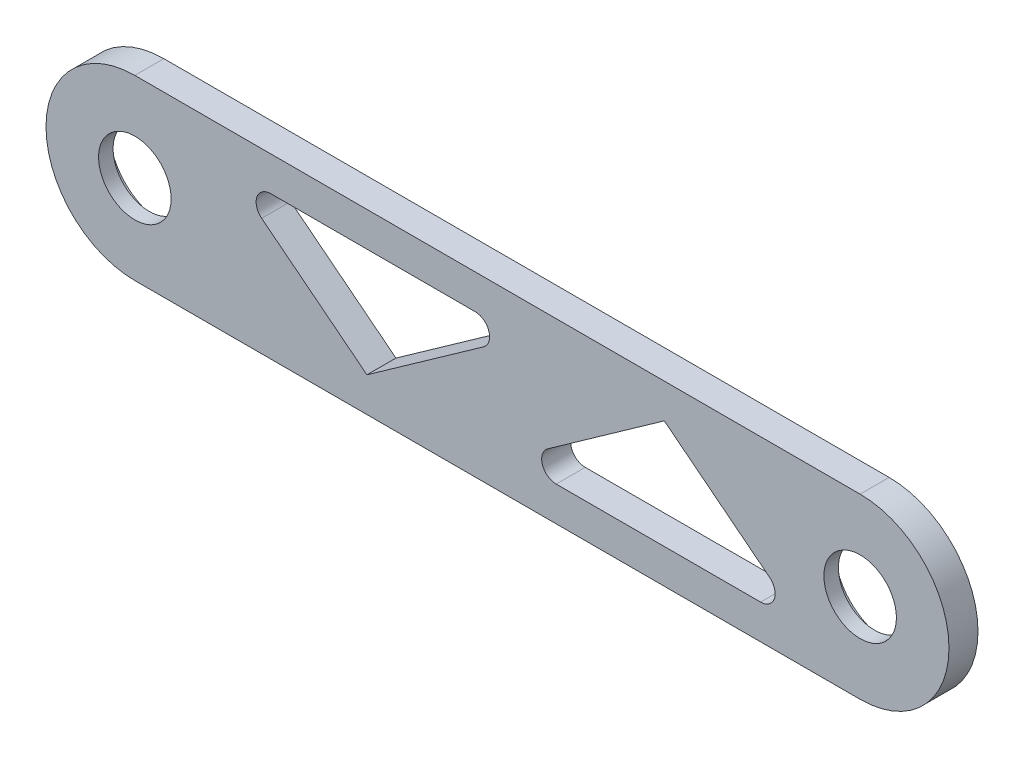
ISO-10303-21;
HEADER;
FILE_DESCRIPTION(('STEP AP214'),'2;1');
FILE_NAME('part.step','',(''),(''),'','','');
FILE_SCHEMA(('AUTOMOTIVE_DESIGN { 1 0 10303 214 1 1 1 1 }'));
ENDSEC;
DATA;
#1=APPLICATION_CONTEXT('core data for automotive mechanical design processes');
#2=APPLICATION_PROTOCOL_DEFINITION('international standard','automotive_design',2000,#1);
#3=PRODUCT_CONTEXT('',#1,'mechanical');
#4=PRODUCT('Part','Part','',(#3));
#5=PRODUCT_RELATED_PRODUCT_CATEGORY('part','',(#4));
#6=PRODUCT_DEFINITION_FORMATION('','',#4);
#7=PRODUCT_DEFINITION_CONTEXT('part definition',#1,'design');
#8=PRODUCT_DEFINITION('design','',#6,#7);
#9=PRODUCT_DEFINITION_SHAPE('','',#8);
#10=(LENGTH_UNIT() NAMED_UNIT(*) SI_UNIT(.MILLI.,.METRE.));
#11=(NAMED_UNIT(*) PLANE_ANGLE_UNIT() SI_UNIT($,.RADIAN.));
#12=(NAMED_UNIT(*) SI_UNIT($,.STERADIAN.) SOLID_ANGLE_UNIT());
#13=UNCERTAINTY_MEASURE_WITH_UNIT(LENGTH_MEASURE(1.E-05),#10,'distance_accuracy_value','');
#14=(GEOMETRIC_REPRESENTATION_CONTEXT(3) GLOBAL_UNCERTAINTY_ASSIGNED_CONTEXT((#13)) GLOBAL_UNIT_ASSIGNED_CONTEXT((#10,
#11,#12)) REPRESENTATION_CONTEXT('',''));
#15=CARTESIAN_POINT('',(0.,0.,0.));
#16=DIRECTION('',(0.,0.,1.));
#17=DIRECTION('',(1.,0.,0.));
#18=AXIS2_PLACEMENT_3D('',#15,#16,#17);
#19=CARTESIAN_POINT('',(0.,0.,4.));
#20=DIRECTION('',(0.,0.,1.));
#21=DIRECTION('',(1.,0.,0.));
#22=AXIS2_PLACEMENT_3D('',#19,#20,#21);
#23=PLANE('',#22);
#24=DIRECTION('',(0.816275942156953,0.577662173121781,0.));
#25=VECTOR('',#24,1.);
#26=CARTESIAN_POINT('',(56.9370226192814,-3.86744811568466,4.));
#27=LINE('',#26,#25);
#28=CARTESIAN_POINT('',(56.9370226192814,-3.86744811568466,4.));
#29=VERTEX_POINT('',#28);
#30=CARTESIAN_POINT('',(73.,7.50000000000141,4.));
#31=VERTEX_POINT('',#30);
#32=EDGE_CURVE('E157',#29,#31,#27,.T.);
#33=ORIENTED_EDGE('',*,*,#32,.T.);
#34=DIRECTION('',(0.785713978588676,-0.61858996423346,0.));
#35=VECTOR('',#34,1.);
#36=CARTESIAN_POINT('',(73.,7.50000000000141,4.));
#37=LINE('',#36,#35);
#38=CARTESIAN_POINT('',(87.5162212912405,-3.92857204282122,4.));
#39=VERTEX_POINT('',#38);
#40=EDGE_CURVE('E143',#31,#39,#37,.T.);
#41=ORIENTED_EDGE('',*,*,#40,.T.);
#42=CARTESIAN_POINT('',(86.2790413627737,-5.49999999999861,4.));
#43=DIRECTION('',(0.,0.,1.));
#44=DIRECTION('',(1.,0.,0.));
#45=AXIS2_PLACEMENT_3D('',#42,#43,#44);
#46=CIRCLE('',#45,2.);
#47=CARTESIAN_POINT('',(86.2790413627736,-7.49999999999861,4.));
#48=VERTEX_POINT('',#47);
#49=EDGE_CURVE('E254',#39,#48,#46,.F.);
#50=ORIENTED_EDGE('',*,*,#49,.T.);
#51=DIRECTION('',(-1.,0.,0.));
#52=VECTOR('',#51,1.);
#53=CARTESIAN_POINT('',(86.2790413627736,-7.49999999999861,4.));
#54=LINE('',#53,#52);
#55=CARTESIAN_POINT('',(58.092346965525,-7.49999999999861,4.));
#56=VERTEX_POINT('',#55);
#57=EDGE_CURVE('E174',#48,#56,#54,.T.);
#58=ORIENTED_EDGE('',*,*,#57,.T.);
#59=CARTESIAN_POINT('',(58.0923469655249,-5.49999999999861,4.));
#60=DIRECTION('',(0.,0.,1.));
#61=DIRECTION('',(1.,0.,0.));
#62=AXIS2_PLACEMENT_3D('',#59,#60,#61);
#63=CIRCLE('',#62,2.);
#64=EDGE_CURVE('E167',#56,#29,#63,.F.);
#65=ORIENTED_EDGE('',*,*,#64,.T.);
#66=EDGE_LOOP('',(#33,#41,#50,#58,#65));
#67=FACE_BOUND('',#66,.T.);
#68=CARTESIAN_POINT('',(18.7209586372264,5.4999999999988,4.));
#69=DIRECTION('',(0.,0.,1.));
#70=DIRECTION('',(1.,0.,0.));
#71=AXIS2_PLACEMENT_3D('',#68,#69,#70);
#72=CIRCLE('',#71,2.);
#73=CARTESIAN_POINT('',(17.4837787087596,3.92857204282137,4.));
#74=VERTEX_POINT('',#73);
#75=CARTESIAN_POINT('',(18.7209586372264,7.4999999999988,4.));
#76=VERTEX_POINT('',#75);
#77=EDGE_CURVE('E213',#74,#76,#72,.F.);
#78=ORIENTED_EDGE('',*,*,#77,.T.);
#79=DIRECTION('',(1.,0.,0.));
#80=VECTOR('',#79,1.);
#81=CARTESIAN_POINT('',(18.7209586372264,7.4999999999988,4.));
#82=LINE('',#81,#80);
#83=CARTESIAN_POINT('',(46.907653034475,7.49999999999864,4.));
#84=VERTEX_POINT('',#83);
#85=EDGE_CURVE('E239',#76,#84,#82,.T.);
#86=ORIENTED_EDGE('',*,*,#85,.T.);
#87=CARTESIAN_POINT('',(46.907653034475,5.49999999999864,4.));
#88=DIRECTION('',(0.,0.,1.));
#89=DIRECTION('',(1.,0.,0.));
#90=AXIS2_PLACEMENT_3D('',#87,#88,#89);
#91=CIRCLE('',#90,2.);
#92=CARTESIAN_POINT('',(48.0629773807184,3.86744811568467,4.));
#93=VERTEX_POINT('',#92);
#94=EDGE_CURVE('E201',#84,#93,#91,.F.);
#95=ORIENTED_EDGE('',*,*,#94,.T.);
#96=DIRECTION('',(-0.816275942156964,-0.577662173121765,0.));
#97=VECTOR('',#96,1.);
#98=CARTESIAN_POINT('',(48.0629773807184,3.86744811568467,4.));
#99=LINE('',#98,#97);
#100=CARTESIAN_POINT('',(32.0000000000002,-7.50000000000065,4.));
#101=VERTEX_POINT('',#100);
#102=EDGE_CURVE('E205',#93,#101,#99,.T.);
#103=ORIENTED_EDGE('',*,*,#102,.T.);
#104=DIRECTION('',(-0.785713978588694,0.618589964233438,0.));
#105=VECTOR('',#104,1.);
#106=CARTESIAN_POINT('',(32.0000000000002,-7.50000000000065,4.));
#107=LINE('',#106,#105);
#108=EDGE_CURVE('E209',#101,#74,#107,.T.);
#109=ORIENTED_EDGE('',*,*,#108,.T.);
#110=EDGE_LOOP('',(#78,#86,#95,#103,#109));
#111=FACE_BOUND('',#110,.T.);
#112=CARTESIAN_POINT('',(0.,0.,4.));
#113=DIRECTION('',(0.,0.,1.));
#114=DIRECTION('',(1.,0.,0.));
#115=AXIS2_PLACEMENT_3D('',#112,#113,#114);
#116=CIRCLE('',#115,5.);
#117=CARTESIAN_POINT('',(5.,0.,4.));
#118=VERTEX_POINT('',#117);
#119=EDGE_CURVE('E267',#118,#118,#116,.T.);
#120=ORIENTED_EDGE('',*,*,#119,.F.);
#121=EDGE_LOOP('',(#120));
#122=FACE_BOUND('',#121,.T.);
#123=CARTESIAN_POINT('',(0.,0.,4.));
#124=DIRECTION('',(0.,0.,1.));
#125=DIRECTION('',(1.,0.,0.));
#126=AXIS2_PLACEMENT_3D('',#123,#124,#125);
#127=CIRCLE('',#126,12.2500000000014);
#128=CARTESIAN_POINT('',(0.,12.2500000000014,4.));
#129=VERTEX_POINT('',#128);
#130=CARTESIAN_POINT('',(0.,-12.2500000000014,4.));
#131=VERTEX_POINT('',#130);
#132=EDGE_CURVE('E272',#129,#131,#127,.T.);
#133=ORIENTED_EDGE('',*,*,#132,.T.);
#134=DIRECTION('',(1.,0.,0.));
#135=VECTOR('',#134,1.);
#136=CARTESIAN_POINT('',(0.,-12.2500000000014,4.));
#137=LINE('',#136,#135);
#138=CARTESIAN_POINT('',(100.,-12.25,4.));
#139=VERTEX_POINT('',#138);
#140=EDGE_CURVE('E276',#131,#139,#137,.T.);
#141=ORIENTED_EDGE('',*,*,#140,.T.);
#142=CARTESIAN_POINT('',(100.,1.39659253553725E-12,4.));
#143=DIRECTION('',(0.,0.,1.));
#144=DIRECTION('',(1.,0.,0.));
#145=AXIS2_PLACEMENT_3D('',#142,#143,#144);
#146=CIRCLE('',#145,12.2500000000014);
#147=CARTESIAN_POINT('',(100.,12.2500000000014,4.));
#148=VERTEX_POINT('',#147);
#149=EDGE_CURVE('E280',#139,#148,#146,.T.);
#150=ORIENTED_EDGE('',*,*,#149,.T.);
#151=DIRECTION('',(-1.,0.,0.));
#152=VECTOR('',#151,1.);
#153=CARTESIAN_POINT('',(0.,12.2500000000014,4.));
#154=LINE('',#153,#152);
#155=EDGE_CURVE('E283',#148,#129,#154,.T.);
#156=ORIENTED_EDGE('',*,*,#155,.T.);
#157=EDGE_LOOP('',(#133,#141,#150,#156));
#158=FACE_BOUND('',#157,.T.);
#159=CARTESIAN_POINT('',(100.,1.39659253553725E-12,4.));
#160=DIRECTION('',(0.,0.,1.));
#161=DIRECTION('',(1.,0.,0.));
#162=AXIS2_PLACEMENT_3D('',#159,#160,#161);
#163=CIRCLE('',#162,5.);
#164=CARTESIAN_POINT('',(105.,1.39659253553725E-12,4.));
#165=VERTEX_POINT('',#164);
#166=EDGE_CURVE('E263',#165,#165,#163,.T.);
#167=ORIENTED_EDGE('',*,*,#166,.F.);
#168=EDGE_LOOP('',(#167));
#169=FACE_BOUND('',#168,.T.);
#170=ADVANCED_FACE('F40',(#67,#111,#122,#158,#169),#23,.T.);
#171=CARTESIAN_POINT('',(0.,0.,0.));
#172=DIRECTION('',(0.,0.,1.));
#173=DIRECTION('',(1.,0.,0.));
#174=AXIS2_PLACEMENT_3D('',#171,#172,#173);
#175=PLANE('',#174);
#176=DIRECTION('',(0.785713978588676,-0.61858996423346,0.));
#177=VECTOR('',#176,1.);
#178=CARTESIAN_POINT('',(73.,7.50000000000141,0.));
#179=LINE('',#178,#177);
#180=CARTESIAN_POINT('',(73.,7.5000000000014,0.));
#181=VERTEX_POINT('',#180);
#182=CARTESIAN_POINT('',(87.5162212912405,-3.92857204282122,0.));
#183=VERTEX_POINT('',#182);
#184=EDGE_CURVE('E172',#181,#183,#179,.T.);
#185=ORIENTED_EDGE('',*,*,#184,.F.);
#186=DIRECTION('',(0.816275942156953,0.577662173121781,0.));
#187=VECTOR('',#186,1.);
#188=CARTESIAN_POINT('',(56.9370226192814,-3.86744811568466,0.));
#189=LINE('',#188,#187);
#190=CARTESIAN_POINT('',(56.9370226192814,-3.86744811568466,0.));
#191=VERTEX_POINT('',#190);
#192=EDGE_CURVE('E160',#191,#181,#189,.T.);
#193=ORIENTED_EDGE('',*,*,#192,.F.);
#194=CARTESIAN_POINT('',(58.0923469655249,-5.49999999999861,0.));
#195=DIRECTION('',(0.,0.,-1.));
#196=DIRECTION('',(-1.,0.,0.));
#197=AXIS2_PLACEMENT_3D('',#194,#195,#196);
#198=CIRCLE('',#197,2.);
#199=CARTESIAN_POINT('',(58.092346965525,-7.49999999999861,0.));
#200=VERTEX_POINT('',#199);
#201=EDGE_CURVE('E162',#200,#191,#198,.T.);
#202=ORIENTED_EDGE('',*,*,#201,.F.);
#203=DIRECTION('',(-1.,0.,0.));
#204=VECTOR('',#203,1.);
#205=CARTESIAN_POINT('',(86.2790413627736,-7.49999999999861,0.));
#206=LINE('',#205,#204);
#207=CARTESIAN_POINT('',(86.2790413627736,-7.49999999999861,0.));
#208=VERTEX_POINT('',#207);
#209=EDGE_CURVE('E184',#208,#200,#206,.T.);
#210=ORIENTED_EDGE('',*,*,#209,.F.);
#211=CARTESIAN_POINT('',(86.2790413627737,-5.49999999999861,0.));
#212=DIRECTION('',(0.,0.,-1.));
#213=DIRECTION('',(1.,0.,0.));
#214=AXIS2_PLACEMENT_3D('',#211,#212,#213);
#215=CIRCLE('',#214,2.);
#216=EDGE_CURVE('E180',#183,#208,#215,.T.);
#217=ORIENTED_EDGE('',*,*,#216,.F.);
#218=EDGE_LOOP('',(#185,#193,#202,#210,#217));
#219=FACE_BOUND('',#218,.T.);
#220=DIRECTION('',(1.,0.,0.));
#221=VECTOR('',#220,1.);
#222=CARTESIAN_POINT('',(18.7209586372264,7.4999999999988,0.));
#223=LINE('',#222,#221);
#224=CARTESIAN_POINT('',(18.7209586372264,7.4999999999988,0.));
#225=VERTEX_POINT('',#224);
#226=CARTESIAN_POINT('',(46.907653034475,7.49999999999864,0.));
#227=VERTEX_POINT('',#226);
#228=EDGE_CURVE('E220',#225,#227,#223,.T.);
#229=ORIENTED_EDGE('',*,*,#228,.F.);
#230=CARTESIAN_POINT('',(18.7209586372264,5.4999999999988,0.));
#231=DIRECTION('',(0.,0.,-1.));
#232=DIRECTION('',(1.,0.,0.));
#233=AXIS2_PLACEMENT_3D('',#230,#231,#232);
#234=CIRCLE('',#233,2.);
#235=CARTESIAN_POINT('',(17.4837787087596,3.92857204282137,0.));
#236=VERTEX_POINT('',#235);
#237=EDGE_CURVE('E217',#236,#225,#234,.T.);
#238=ORIENTED_EDGE('',*,*,#237,.F.);
#239=DIRECTION('',(-0.785713978588693,0.618589964233438,0.));
#240=VECTOR('',#239,1.);
#241=CARTESIAN_POINT('',(32.0000000000002,-7.50000000000065,0.));
#242=LINE('',#241,#240);
#243=CARTESIAN_POINT('',(32.0000000000002,-7.50000000000065,0.));
#244=VERTEX_POINT('',#243);
#245=EDGE_CURVE('E231',#244,#236,#242,.T.);
#246=ORIENTED_EDGE('',*,*,#245,.F.);
#247=DIRECTION('',(-0.816275942156964,-0.577662173121765,0.));
#248=VECTOR('',#247,1.);
#249=CARTESIAN_POINT('',(48.0629773807184,3.86744811568467,0.));
#250=LINE('',#249,#248);
#251=CARTESIAN_POINT('',(48.0629773807184,3.86744811568467,0.));
#252=VERTEX_POINT('',#251);
#253=EDGE_CURVE('E227',#252,#244,#250,.T.);
#254=ORIENTED_EDGE('',*,*,#253,.F.);
#255=CARTESIAN_POINT('',(46.907653034475,5.49999999999864,0.));
#256=DIRECTION('',(0.,0.,-1.));
#257=DIRECTION('',(-1.,0.,0.));
#258=AXIS2_PLACEMENT_3D('',#255,#256,#257);
#259=CIRCLE('',#258,2.);
#260=EDGE_CURVE('E223',#227,#252,#259,.T.);
#261=ORIENTED_EDGE('',*,*,#260,.F.);
#262=EDGE_LOOP('',(#229,#238,#246,#254,#261));
#263=FACE_BOUND('',#262,.T.);
#264=CARTESIAN_POINT('',(0.,0.,0.));
#265=DIRECTION('',(0.,0.,1.));
#266=DIRECTION('',(1.,0.,0.));
#267=AXIS2_PLACEMENT_3D('',#264,#265,#266);
#268=CIRCLE('',#267,7.5);
#269=CARTESIAN_POINT('',(7.5,0.,0.));
#270=VERTEX_POINT('',#269);
#271=EDGE_CURVE('E44',#270,#270,#268,.T.);
#272=ORIENTED_EDGE('',*,*,#271,.T.);
#273=EDGE_LOOP('',(#272));
#274=FACE_BOUND('',#273,.T.);
#275=CARTESIAN_POINT('',(100.,1.39659253553725E-12,0.));
#276=DIRECTION('',(0.,0.,1.));
#277=DIRECTION('',(1.,0.,0.));
#278=AXIS2_PLACEMENT_3D('',#275,#276,#277);
#279=CIRCLE('',#278,7.50000000000001);
#280=CARTESIAN_POINT('',(107.5,1.39659253553725E-12,0.));
#281=VERTEX_POINT('',#280);
#282=EDGE_CURVE('E314',#281,#281,#279,.T.);
#283=ORIENTED_EDGE('',*,*,#282,.T.);
#284=EDGE_LOOP('',(#283));
#285=FACE_BOUND('',#284,.T.);
#286=CARTESIAN_POINT('',(0.,0.,0.));
#287=DIRECTION('',(0.,0.,1.));
#288=DIRECTION('',(1.,0.,0.));
#289=AXIS2_PLACEMENT_3D('',#286,#287,#288);
#290=CIRCLE('',#289,12.2500000000014);
#291=CARTESIAN_POINT('',(0.,12.2500000000014,0.));
#292=VERTEX_POINT('',#291);
#293=CARTESIAN_POINT('',(0.,-12.2500000000014,0.));
#294=VERTEX_POINT('',#293);
#295=EDGE_CURVE('E271',#292,#294,#290,.T.);
#296=ORIENTED_EDGE('',*,*,#295,.F.);
#297=DIRECTION('',(-1.,0.,0.));
#298=VECTOR('',#297,1.);
#299=CARTESIAN_POINT('',(0.,12.2500000000014,0.));
#300=LINE('',#299,#298);
#301=CARTESIAN_POINT('',(100.,12.2500000000014,0.));
#302=VERTEX_POINT('',#301);
#303=EDGE_CURVE('E277',#302,#292,#300,.T.);
#304=ORIENTED_EDGE('',*,*,#303,.F.);
#305=CARTESIAN_POINT('',(100.,1.39659253553725E-12,0.));
#306=DIRECTION('',(0.,0.,1.));
#307=DIRECTION('',(1.,0.,0.));
#308=AXIS2_PLACEMENT_3D('',#305,#306,#307);
#309=CIRCLE('',#308,12.2500000000014);
#310=CARTESIAN_POINT('',(100.,-12.25,0.));
#311=VERTEX_POINT('',#310);
#312=EDGE_CURVE('E293',#311,#302,#309,.T.);
#313=ORIENTED_EDGE('',*,*,#312,.F.);
#314=DIRECTION('',(1.,0.,0.));
#315=VECTOR('',#314,1.);
#316=CARTESIAN_POINT('',(0.,-12.2500000000014,0.));
#317=LINE('',#316,#315);
#318=EDGE_CURVE('E290',#294,#311,#317,.T.);
#319=ORIENTED_EDGE('',*,*,#318,.F.);
#320=EDGE_LOOP('',(#296,#304,#313,#319));
#321=FACE_BOUND('',#320,.T.);
#322=ADVANCED_FACE('F323',(#219,#263,#274,#285,#321),#175,.F.);
#323=CARTESIAN_POINT('',(0.,0.,4.));
#324=DIRECTION('',(0.,0.,-1.));
#325=DIRECTION('',(-1.,0.,0.));
#326=AXIS2_PLACEMENT_3D('',#323,#324,#325);
#327=CYLINDRICAL_SURFACE('',#326,12.2500000000014);
#328=ORIENTED_EDGE('',*,*,#295,.T.);
#329=DIRECTION('',(0.,0.,-1.));
#330=VECTOR('',#329,1.);
#331=CARTESIAN_POINT('',(0.,-12.2500000000014,4.));
#332=LINE('',#331,#330);
#333=EDGE_CURVE('E11',#131,#294,#332,.T.);
#334=ORIENTED_EDGE('',*,*,#333,.F.);
#335=ORIENTED_EDGE('',*,*,#132,.F.);
#336=DIRECTION('',(0.,0.,-1.));
#337=VECTOR('',#336,1.);
#338=CARTESIAN_POINT('',(0.,12.2500000000014,4.));
#339=LINE('',#338,#337);
#340=EDGE_CURVE('E286',#129,#292,#339,.T.);
#341=ORIENTED_EDGE('',*,*,#340,.T.);
#342=EDGE_LOOP('',(#328,#334,#335,#341));
#343=FACE_BOUND('',#342,.T.);
#344=ADVANCED_FACE('F42',(#343),#327,.T.);
#345=CARTESIAN_POINT('',(0.,-12.2500000000014,4.));
#346=DIRECTION('',(0.,1.,0.));
#347=DIRECTION('',(0.,0.,1.));
#348=AXIS2_PLACEMENT_3D('',#345,#346,#347);
#349=PLANE('',#348);
#350=ORIENTED_EDGE('',*,*,#318,.T.);
#351=DIRECTION('',(0.,0.,-1.));
#352=VECTOR('',#351,1.);
#353=CARTESIAN_POINT('',(100.,-12.25,4.));
#354=LINE('',#353,#352);
#355=EDGE_CURVE('E50',#139,#311,#354,.T.);
#356=ORIENTED_EDGE('',*,*,#355,.F.);
#357=ORIENTED_EDGE('',*,*,#140,.F.);
#358=ORIENTED_EDGE('',*,*,#333,.T.);
#359=EDGE_LOOP('',(#350,#356,#357,#358));
#360=FACE_BOUND('',#359,.T.);
#361=ADVANCED_FACE('F359',(#360),#349,.F.);
#362=CARTESIAN_POINT('',(100.,1.39659253553725E-12,4.));
#363=DIRECTION('',(0.,0.,-1.));
#364=DIRECTION('',(-1.,0.,0.));
#365=AXIS2_PLACEMENT_3D('',#362,#363,#364);
#366=CYLINDRICAL_SURFACE('',#365,12.2500000000014);
#367=ORIENTED_EDGE('',*,*,#312,.T.);
#368=DIRECTION('',(0.,0.,-1.));
#369=VECTOR('',#368,1.);
#370=CARTESIAN_POINT('',(100.,12.2500000000014,4.));
#371=LINE('',#370,#369);
#372=EDGE_CURVE('E301',#148,#302,#371,.T.);
#373=ORIENTED_EDGE('',*,*,#372,.F.);
#374=ORIENTED_EDGE('',*,*,#149,.F.);
#375=ORIENTED_EDGE('',*,*,#355,.T.);
#376=EDGE_LOOP('',(#367,#373,#374,#375));
#377=FACE_BOUND('',#376,.T.);
#378=ADVANCED_FACE('F356',(#377),#366,.T.);
#379=CARTESIAN_POINT('',(0.,12.2500000000014,4.));
#380=DIRECTION('',(0.,-1.,0.));
#381=DIRECTION('',(0.,0.,-1.));
#382=AXIS2_PLACEMENT_3D('',#379,#380,#381);
#383=PLANE('',#382);
#384=ORIENTED_EDGE('',*,*,#303,.T.);
#385=ORIENTED_EDGE('',*,*,#340,.F.);
#386=ORIENTED_EDGE('',*,*,#155,.F.);
#387=ORIENTED_EDGE('',*,*,#372,.T.);
#388=EDGE_LOOP('',(#384,#385,#386,#387));
#389=FACE_BOUND('',#388,.T.);
#390=ADVANCED_FACE('F353',(#389),#383,.F.);
#391=CARTESIAN_POINT('',(0.,0.,4.));
#392=DIRECTION('',(0.,0.,-1.));
#393=DIRECTION('',(-1.,0.,0.));
#394=AXIS2_PLACEMENT_3D('',#391,#392,#393);
#395=CYLINDRICAL_SURFACE('',#394,5.);
#396=CARTESIAN_POINT('',(0.,0.,2.));
#397=DIRECTION('',(0.,0.,1.));
#398=DIRECTION('',(1.,0.,0.));
#399=AXIS2_PLACEMENT_3D('',#396,#397,#398);
#400=CIRCLE('',#399,5.);
#401=CARTESIAN_POINT('',(5.,0.,2.));
#402=VERTEX_POINT('',#401);
#403=EDGE_CURVE('E311',#402,#402,#400,.T.);
#404=ORIENTED_EDGE('',*,*,#403,.F.);
#405=EDGE_LOOP('',(#404));
#406=FACE_BOUND('',#405,.T.);
#407=ORIENTED_EDGE('',*,*,#119,.T.);
#408=EDGE_LOOP('',(#407));
#409=FACE_BOUND('',#408,.T.);
#410=ADVANCED_FACE('F350',(#406,#409),#395,.F.);
#411=CARTESIAN_POINT('',(100.,1.39659253553725E-12,4.));
#412=DIRECTION('',(0.,0.,-1.));
#413=DIRECTION('',(-1.,0.,0.));
#414=AXIS2_PLACEMENT_3D('',#411,#412,#413);
#415=CYLINDRICAL_SURFACE('',#414,5.);
#416=CARTESIAN_POINT('',(100.,1.39659253553725E-12,2.));
#417=DIRECTION('',(0.,0.,1.));
#418=DIRECTION('',(1.,0.,0.));
#419=AXIS2_PLACEMENT_3D('',#416,#417,#418);
#420=CIRCLE('',#419,5.);
#421=CARTESIAN_POINT('',(105.,1.39659253553725E-12,2.));
#422=VERTEX_POINT('',#421);
#423=EDGE_CURVE('E259',#422,#422,#420,.T.);
#424=ORIENTED_EDGE('',*,*,#423,.F.);
#425=EDGE_LOOP('',(#424));
#426=FACE_BOUND('',#425,.T.);
#427=ORIENTED_EDGE('',*,*,#166,.T.);
#428=EDGE_LOOP('',(#427));
#429=FACE_BOUND('',#428,.T.);
#430=ADVANCED_FACE('F382',(#426,#429),#415,.F.);
#431=CARTESIAN_POINT('',(100.,1.39659253553725E-12,-1.));
#432=DIRECTION('',(0.,0.,1.));
#433=DIRECTION('',(1.,0.,0.));
#434=AXIS2_PLACEMENT_3D('',#431,#432,#433);
#435=CYLINDRICAL_SURFACE('',#434,7.50000000000001);
#436=CARTESIAN_POINT('',(100.,1.39659253553725E-12,2.));
#437=DIRECTION('',(0.,0.,1.));
#438=DIRECTION('',(1.,0.,0.));
#439=AXIS2_PLACEMENT_3D('',#436,#437,#438);
#440=CIRCLE('',#439,7.50000000000001);
#441=CARTESIAN_POINT('',(107.5,1.39659253553725E-12,2.));
#442=VERTEX_POINT('',#441);
#443=EDGE_CURVE('E152',#442,#442,#440,.T.);
#444=ORIENTED_EDGE('',*,*,#443,.T.);
#445=EDGE_LOOP('',(#444));
#446=FACE_BOUND('',#445,.T.);
#447=ORIENTED_EDGE('',*,*,#282,.F.);
#448=EDGE_LOOP('',(#447));
#449=FACE_BOUND('',#448,.T.);
#450=ADVANCED_FACE('F338',(#446,#449),#435,.F.);
#451=CARTESIAN_POINT('',(100.,1.39659253553725E-12,2.));
#452=DIRECTION('',(0.,0.,1.));
#453=DIRECTION('',(1.,0.,0.));
#454=AXIS2_PLACEMENT_3D('',#451,#452,#453);
#455=PLANE('',#454);
#456=ORIENTED_EDGE('',*,*,#423,.T.);
#457=EDGE_LOOP('',(#456));
#458=FACE_BOUND('',#457,.T.);
#459=ORIENTED_EDGE('',*,*,#443,.F.);
#460=EDGE_LOOP('',(#459));
#461=FACE_BOUND('',#460,.T.);
#462=ADVANCED_FACE('F328',(#458,#461),#455,.F.);
#463=CARTESIAN_POINT('',(0.,0.,-1.));
#464=DIRECTION('',(0.,0.,1.));
#465=DIRECTION('',(1.,0.,0.));
#466=AXIS2_PLACEMENT_3D('',#463,#464,#465);
#467=CYLINDRICAL_SURFACE('',#466,7.5);
#468=CARTESIAN_POINT('',(0.,0.,2.));
#469=DIRECTION('',(0.,0.,1.));
#470=DIRECTION('',(1.,0.,0.));
#471=AXIS2_PLACEMENT_3D('',#468,#469,#470);
#472=CIRCLE('',#471,7.5);
#473=CARTESIAN_POINT('',(7.5,0.,2.));
#474=VERTEX_POINT('',#473);
#475=EDGE_CURVE('E255',#474,#474,#472,.T.);
#476=ORIENTED_EDGE('',*,*,#475,.T.);
#477=EDGE_LOOP('',(#476));
#478=FACE_BOUND('',#477,.T.);
#479=ORIENTED_EDGE('',*,*,#271,.F.);
#480=EDGE_LOOP('',(#479));
#481=FACE_BOUND('',#480,.T.);
#482=ADVANCED_FACE('F325',(#478,#481),#467,.F.);
#483=CARTESIAN_POINT('',(0.,0.,2.));
#484=DIRECTION('',(0.,0.,1.));
#485=DIRECTION('',(1.,0.,0.));
#486=AXIS2_PLACEMENT_3D('',#483,#484,#485);
#487=PLANE('',#486);
#488=ORIENTED_EDGE('',*,*,#403,.T.);
#489=EDGE_LOOP('',(#488));
#490=FACE_BOUND('',#489,.T.);
#491=ORIENTED_EDGE('',*,*,#475,.F.);
#492=EDGE_LOOP('',(#491));
#493=FACE_BOUND('',#492,.T.);
#494=ADVANCED_FACE('F327',(#490,#493),#487,.F.);
#495=CARTESIAN_POINT('',(18.7209586372264,5.4999999999988,4.001));
#496=DIRECTION('',(0.,0.,-1.));
#497=DIRECTION('',(-1.,0.,0.));
#498=AXIS2_PLACEMENT_3D('',#495,#496,#497);
#499=CYLINDRICAL_SURFACE('',#498,2.);
#500=DIRECTION('',(0.,0.,-1.));
#501=VECTOR('',#500,1.);
#502=CARTESIAN_POINT('',(17.4837787087596,3.92857204282137,4.001));
#503=LINE('',#502,#501);
#504=EDGE_CURVE('E236',#74,#236,#503,.T.);
#505=ORIENTED_EDGE('',*,*,#504,.T.);
#506=ORIENTED_EDGE('',*,*,#237,.T.);
#507=DIRECTION('',(0.,0.,-1.));
#508=VECTOR('',#507,1.);
#509=CARTESIAN_POINT('',(18.7209586372264,7.4999999999988,4.001));
#510=LINE('',#509,#508);
#511=EDGE_CURVE('E235',#76,#225,#510,.T.);
#512=ORIENTED_EDGE('',*,*,#511,.F.);
#513=ORIENTED_EDGE('',*,*,#77,.F.);
#514=EDGE_LOOP('',(#505,#506,#512,#513));
#515=FACE_BOUND('',#514,.T.);
#516=ADVANCED_FACE('F335',(#515),#499,.F.);
#517=CARTESIAN_POINT('',(32.0000000000002,-7.50000000000065,4.001));
#518=DIRECTION('',(-0.618589964233438,-0.785713978588694,0.));
#519=DIRECTION('',(0.785713978588694,-0.618589964233438,0.));
#520=AXIS2_PLACEMENT_3D('',#517,#518,#519);
#521=PLANE('',#520);
#522=DIRECTION('',(0.,0.,-1.));
#523=VECTOR('',#522,1.);
#524=CARTESIAN_POINT('',(32.0000000000002,-7.50000000000065,4.001));
#525=LINE('',#524,#523);
#526=EDGE_CURVE('E240',#101,#244,#525,.T.);
#527=ORIENTED_EDGE('',*,*,#526,.T.);
#528=ORIENTED_EDGE('',*,*,#245,.T.);
#529=ORIENTED_EDGE('',*,*,#504,.F.);
#530=ORIENTED_EDGE('',*,*,#108,.F.);
#531=EDGE_LOOP('',(#527,#528,#529,#530));
#532=FACE_BOUND('',#531,.T.);
#533=ADVANCED_FACE('F441',(#532),#521,.F.);
#534=CARTESIAN_POINT('',(48.0629773807184,3.86744811568467,4.001));
#535=DIRECTION('',(0.577662173121765,-0.816275942156964,0.));
#536=DIRECTION('',(0.816275942156964,0.577662173121765,0.));
#537=AXIS2_PLACEMENT_3D('',#534,#535,#536);
#538=PLANE('',#537);
#539=DIRECTION('',(0.,0.,-1.));
#540=VECTOR('',#539,1.);
#541=CARTESIAN_POINT('',(48.0629773807184,3.86744811568467,4.001));
#542=LINE('',#541,#540);
#543=EDGE_CURVE('E243',#93,#252,#542,.T.);
#544=ORIENTED_EDGE('',*,*,#543,.T.);
#545=ORIENTED_EDGE('',*,*,#253,.T.);
#546=ORIENTED_EDGE('',*,*,#526,.F.);
#547=ORIENTED_EDGE('',*,*,#102,.F.);
#548=EDGE_LOOP('',(#544,#545,#546,#547));
#549=FACE_BOUND('',#548,.T.);
#550=ADVANCED_FACE('F452',(#549),#538,.F.);
#551=CARTESIAN_POINT('',(46.907653034475,5.49999999999864,4.001));
#552=DIRECTION('',(0.,0.,-1.));
#553=DIRECTION('',(-1.,0.,0.));
#554=AXIS2_PLACEMENT_3D('',#551,#552,#553);
#555=CYLINDRICAL_SURFACE('',#554,2.);
#556=DIRECTION('',(0.,0.,-1.));
#557=VECTOR('',#556,1.);
#558=CARTESIAN_POINT('',(46.907653034475,7.49999999999864,4.001));
#559=LINE('',#558,#557);
#560=EDGE_CURVE('E66',#84,#227,#559,.T.);
#561=ORIENTED_EDGE('',*,*,#560,.T.);
#562=ORIENTED_EDGE('',*,*,#260,.T.);
#563=ORIENTED_EDGE('',*,*,#543,.F.);
#564=ORIENTED_EDGE('',*,*,#94,.F.);
#565=EDGE_LOOP('',(#561,#562,#563,#564));
#566=FACE_BOUND('',#565,.T.);
#567=ADVANCED_FACE('F462',(#566),#555,.F.);
#568=CARTESIAN_POINT('',(18.7209586372264,7.4999999999988,4.001));
#569=DIRECTION('',(0.,1.,0.));
#570=DIRECTION('',(-1.,0.,0.));
#571=AXIS2_PLACEMENT_3D('',#568,#569,#570);
#572=PLANE('',#571);
#573=ORIENTED_EDGE('',*,*,#511,.T.);
#574=ORIENTED_EDGE('',*,*,#228,.T.);
#575=ORIENTED_EDGE('',*,*,#560,.F.);
#576=ORIENTED_EDGE('',*,*,#85,.F.);
#577=EDGE_LOOP('',(#573,#574,#575,#576));
#578=FACE_BOUND('',#577,.T.);
#579=ADVANCED_FACE('F472',(#578),#572,.F.);
#580=CARTESIAN_POINT('',(56.9370226192814,-3.86744811568466,4.001));
#581=DIRECTION('',(-0.577662173121781,0.816275942156953,0.));
#582=DIRECTION('',(-0.816275942156953,-0.577662173121781,0.));
#583=AXIS2_PLACEMENT_3D('',#580,#581,#582);
#584=PLANE('',#583);
#585=DIRECTION('',(0.,0.,-1.));
#586=VECTOR('',#585,1.);
#587=CARTESIAN_POINT('',(56.9370226192814,-3.86744811568466,4.001));
#588=LINE('',#587,#586);
#589=EDGE_CURVE('E153',#29,#191,#588,.T.);
#590=ORIENTED_EDGE('',*,*,#589,.T.);
#591=ORIENTED_EDGE('',*,*,#192,.T.);
#592=DIRECTION('',(0.,0.,-1.));
#593=VECTOR('',#592,1.);
#594=CARTESIAN_POINT('',(73.,7.50000000000141,4.001));
#595=LINE('',#594,#593);
#596=EDGE_CURVE('E146',#31,#181,#595,.T.);
#597=ORIENTED_EDGE('',*,*,#596,.F.);
#598=ORIENTED_EDGE('',*,*,#32,.F.);
#599=EDGE_LOOP('',(#590,#591,#597,#598));
#600=FACE_BOUND('',#599,.T.);
#601=ADVANCED_FACE('F156',(#600),#584,.F.);
#602=CARTESIAN_POINT('',(58.0923469655249,-5.49999999999861,4.001));
#603=DIRECTION('',(0.,0.,-1.));
#604=DIRECTION('',(-1.,0.,0.));
#605=AXIS2_PLACEMENT_3D('',#602,#603,#604);
#606=CYLINDRICAL_SURFACE('',#605,2.);
#607=DIRECTION('',(0.,0.,-1.));
#608=VECTOR('',#607,1.);
#609=CARTESIAN_POINT('',(58.092346965525,-7.49999999999861,4.001));
#610=LINE('',#609,#608);
#611=EDGE_CURVE('E193',#56,#200,#610,.T.);
#612=ORIENTED_EDGE('',*,*,#611,.T.);
#613=ORIENTED_EDGE('',*,*,#201,.T.);
#614=ORIENTED_EDGE('',*,*,#589,.F.);
#615=ORIENTED_EDGE('',*,*,#64,.F.);
#616=EDGE_LOOP('',(#612,#613,#614,#615));
#617=FACE_BOUND('',#616,.T.);
#618=ADVANCED_FACE('F490',(#617),#606,.F.);
#619=CARTESIAN_POINT('',(86.2790413627736,-7.49999999999861,4.001));
#620=DIRECTION('',(0.,-1.,0.));
#621=DIRECTION('',(1.,0.,0.));
#622=AXIS2_PLACEMENT_3D('',#619,#620,#621);
#623=PLANE('',#622);
#624=DIRECTION('',(0.,0.,-1.));
#625=VECTOR('',#624,1.);
#626=CARTESIAN_POINT('',(86.2790413627736,-7.49999999999861,4.001));
#627=LINE('',#626,#625);
#628=EDGE_CURVE('E196',#48,#208,#627,.T.);
#629=ORIENTED_EDGE('',*,*,#628,.T.);
#630=ORIENTED_EDGE('',*,*,#209,.T.);
#631=ORIENTED_EDGE('',*,*,#611,.F.);
#632=ORIENTED_EDGE('',*,*,#57,.F.);
#633=EDGE_LOOP('',(#629,#630,#631,#632));
#634=FACE_BOUND('',#633,.T.);
#635=ADVANCED_FACE('F499',(#634),#623,.F.);
#636=CARTESIAN_POINT('',(86.2790413627737,-5.49999999999861,4.001));
#637=DIRECTION('',(0.,0.,-1.));
#638=DIRECTION('',(-1.,0.,0.));
#639=AXIS2_PLACEMENT_3D('',#636,#637,#638);
#640=CYLINDRICAL_SURFACE('',#639,2.);
#641=DIRECTION('',(0.,0.,-1.));
#642=VECTOR('',#641,1.);
#643=CARTESIAN_POINT('',(87.5162212912405,-3.92857204282122,4.001));
#644=LINE('',#643,#642);
#645=EDGE_CURVE('E58',#39,#183,#644,.T.);
#646=ORIENTED_EDGE('',*,*,#645,.T.);
#647=ORIENTED_EDGE('',*,*,#216,.T.);
#648=ORIENTED_EDGE('',*,*,#628,.F.);
#649=ORIENTED_EDGE('',*,*,#49,.F.);
#650=EDGE_LOOP('',(#646,#647,#648,#649));
#651=FACE_BOUND('',#650,.T.);
#652=ADVANCED_FACE('F509',(#651),#640,.F.);
#653=CARTESIAN_POINT('',(73.,7.50000000000141,4.001));
#654=DIRECTION('',(0.61858996423346,0.785713978588676,0.));
#655=DIRECTION('',(-0.785713978588676,0.61858996423346,0.));
#656=AXIS2_PLACEMENT_3D('',#653,#654,#655);
#657=PLANE('',#656);
#658=ORIENTED_EDGE('',*,*,#596,.T.);
#659=ORIENTED_EDGE('',*,*,#184,.T.);
#660=ORIENTED_EDGE('',*,*,#645,.F.);
#661=ORIENTED_EDGE('',*,*,#40,.F.);
#662=EDGE_LOOP('',(#658,#659,#660,#661));
#663=FACE_BOUND('',#662,.T.);
#664=ADVANCED_FACE('F145',(#663),#657,.F.);
#665=CLOSED_SHELL('',(#170,#322,#344,#361,#378,#390,#410,#430,#450,#462,#482,#494,#516,#533,
#550,#567,#579,#601,#618,#635,#652,#664));
#666=MANIFOLD_SOLID_BREP('B2',#665);
#667=ADVANCED_BREP_SHAPE_REPRESENTATION('',(#18,#666),#14);
#668=SHAPE_DEFINITION_REPRESENTATION(#9,#667);
ENDSEC;
END-ISO-10303-21;
